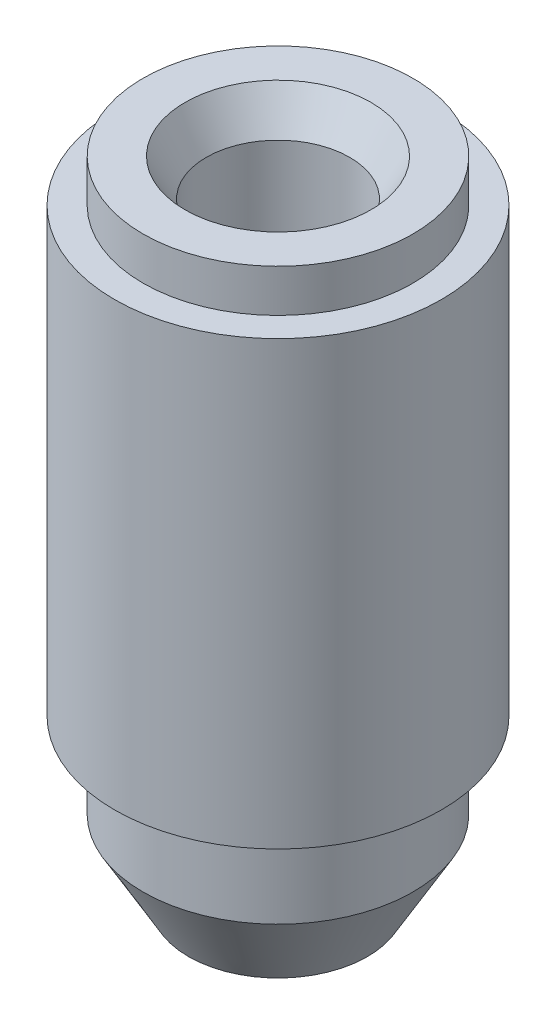
ISO-10303-21;
HEADER;
FILE_DESCRIPTION(('STEP AP214'),'2;1');
FILE_NAME('part.step','',(''),(''),'','','');
FILE_SCHEMA(('AUTOMOTIVE_DESIGN { 1 0 10303 214 1 1 1 1 }'));
ENDSEC;
DATA;
#1=APPLICATION_CONTEXT('core data for automotive mechanical design processes');
#2=APPLICATION_PROTOCOL_DEFINITION('international standard','automotive_design',2000,#1);
#3=PRODUCT_CONTEXT('',#1,'mechanical');
#4=PRODUCT('Part','Part','',(#3));
#5=PRODUCT_RELATED_PRODUCT_CATEGORY('part','',(#4));
#6=PRODUCT_DEFINITION_FORMATION('','',#4);
#7=PRODUCT_DEFINITION_CONTEXT('part definition',#1,'design');
#8=PRODUCT_DEFINITION('design','',#6,#7);
#9=PRODUCT_DEFINITION_SHAPE('','',#8);
#10=(LENGTH_UNIT() NAMED_UNIT(*) SI_UNIT(.MILLI.,.METRE.));
#11=(NAMED_UNIT(*) PLANE_ANGLE_UNIT() SI_UNIT($,.RADIAN.));
#12=(NAMED_UNIT(*) SI_UNIT($,.STERADIAN.) SOLID_ANGLE_UNIT());
#13=UNCERTAINTY_MEASURE_WITH_UNIT(LENGTH_MEASURE(1.E-05),#10,'distance_accuracy_value','');
#14=(GEOMETRIC_REPRESENTATION_CONTEXT(3) GLOBAL_UNCERTAINTY_ASSIGNED_CONTEXT((#13)) GLOBAL_UNIT_ASSIGNED_CONTEXT((#10,
#11,#12)) REPRESENTATION_CONTEXT('',''));
#15=CARTESIAN_POINT('',(0.,0.,0.));
#16=DIRECTION('',(0.,0.,1.));
#17=DIRECTION('',(1.,0.,0.));
#18=AXIS2_PLACEMENT_3D('',#15,#16,#17);
#19=CARTESIAN_POINT('',(5.05,18.56,0.));
#20=DIRECTION('',(0.,-1.,0.));
#21=DIRECTION('',(0.,0.,-1.));
#22=AXIS2_PLACEMENT_3D('',#19,#20,#21);
#23=PLANE('',#22);
#24=CARTESIAN_POINT('',(0.,18.56,0.));
#25=DIRECTION('',(0.,-1.,0.));
#26=DIRECTION('',(0.,0.,-1.));
#27=AXIS2_PLACEMENT_3D('',#24,#25,#26);
#28=CIRCLE('',#27,6.55000000000001);
#29=CARTESIAN_POINT('',(0.,18.56,-6.55000000000001));
#30=VERTEX_POINT('',#29);
#31=EDGE_CURVE('E10',#30,#30,#28,.T.);
#32=ORIENTED_EDGE('',*,*,#31,.T.);
#33=EDGE_LOOP('',(#32));
#34=FACE_BOUND('',#33,.T.);
#35=CARTESIAN_POINT('',(0.,18.56,0.));
#36=DIRECTION('',(0.,1.,0.));
#37=DIRECTION('',(0.,0.,1.));
#38=AXIS2_PLACEMENT_3D('',#35,#36,#37);
#39=CIRCLE('',#38,9.50000000000001);
#40=CARTESIAN_POINT('',(0.,18.56,9.50000000000001));
#41=VERTEX_POINT('',#40);
#42=EDGE_CURVE('E43',#41,#41,#39,.T.);
#43=ORIENTED_EDGE('',*,*,#42,.T.);
#44=EDGE_LOOP('',(#43));
#45=FACE_BOUND('',#44,.T.);
#46=ADVANCED_FACE('F32',(#34,#45),#23,.F.);
#47=CARTESIAN_POINT('',(0.,19.5331704023665,0.));
#48=DIRECTION('',(0.,1.,0.));
#49=DIRECTION('',(0.,0.,1.));
#50=AXIS2_PLACEMENT_3D('',#47,#48,#49);
#51=CYLINDRICAL_SURFACE('',#50,9.50000000000001);
#52=ORIENTED_EDGE('',*,*,#42,.F.);
#53=EDGE_LOOP('',(#52));
#54=FACE_BOUND('',#53,.T.);
#55=CARTESIAN_POINT('',(0.,15.56,0.));
#56=DIRECTION('',(0.,1.,0.));
#57=DIRECTION('',(0.,0.,1.));
#58=AXIS2_PLACEMENT_3D('',#55,#56,#57);
#59=CIRCLE('',#58,9.50000000000001);
#60=CARTESIAN_POINT('',(0.,15.56,9.50000000000001));
#61=VERTEX_POINT('',#60);
#62=EDGE_CURVE('E47',#61,#61,#59,.T.);
#63=ORIENTED_EDGE('',*,*,#62,.T.);
#64=EDGE_LOOP('',(#63));
#65=FACE_BOUND('',#64,.T.);
#66=ADVANCED_FACE('F85',(#54,#65),#51,.T.);
#67=CARTESIAN_POINT('',(9.50000000000001,15.56,0.));
#68=DIRECTION('',(0.,-1.,0.));
#69=DIRECTION('',(0.,0.,-1.));
#70=AXIS2_PLACEMENT_3D('',#67,#68,#69);
#71=PLANE('',#70);
#72=ORIENTED_EDGE('',*,*,#62,.F.);
#73=EDGE_LOOP('',(#72));
#74=FACE_BOUND('',#73,.T.);
#75=CARTESIAN_POINT('',(0.,15.56,0.));
#76=DIRECTION('',(0.,1.,0.));
#77=DIRECTION('',(0.,0.,1.));
#78=AXIS2_PLACEMENT_3D('',#75,#76,#77);
#79=CIRCLE('',#78,11.5);
#80=CARTESIAN_POINT('',(0.,15.56,11.5));
#81=VERTEX_POINT('',#80);
#82=EDGE_CURVE('E52',#81,#81,#79,.T.);
#83=ORIENTED_EDGE('',*,*,#82,.T.);
#84=EDGE_LOOP('',(#83));
#85=FACE_BOUND('',#84,.T.);
#86=ADVANCED_FACE('F89',(#74,#85),#71,.F.);
#87=CARTESIAN_POINT('',(0.,19.5331704023665,0.));
#88=DIRECTION('',(0.,1.,0.));
#89=DIRECTION('',(0.,0.,1.));
#90=AXIS2_PLACEMENT_3D('',#87,#88,#89);
#91=CYLINDRICAL_SURFACE('',#90,11.5);
#92=ORIENTED_EDGE('',*,*,#82,.F.);
#93=EDGE_LOOP('',(#92));
#94=FACE_BOUND('',#93,.T.);
#95=CARTESIAN_POINT('',(0.,-15.56,0.));
#96=DIRECTION('',(0.,1.,0.));
#97=DIRECTION('',(0.,0.,1.));
#98=AXIS2_PLACEMENT_3D('',#95,#96,#97);
#99=CIRCLE('',#98,11.5);
#100=CARTESIAN_POINT('',(0.,-15.56,11.5));
#101=VERTEX_POINT('',#100);
#102=EDGE_CURVE('E55',#101,#101,#99,.T.);
#103=ORIENTED_EDGE('',*,*,#102,.T.);
#104=EDGE_LOOP('',(#103));
#105=FACE_BOUND('',#104,.T.);
#106=ADVANCED_FACE('F96',(#94,#105),#91,.T.);
#107=CARTESIAN_POINT('',(9.50000000000001,-15.56,0.));
#108=DIRECTION('',(0.,1.,0.));
#109=DIRECTION('',(0.,0.,1.));
#110=AXIS2_PLACEMENT_3D('',#107,#108,#109);
#111=PLANE('',#110);
#112=ORIENTED_EDGE('',*,*,#102,.F.);
#113=EDGE_LOOP('',(#112));
#114=FACE_BOUND('',#113,.T.);
#115=CARTESIAN_POINT('',(0.,-15.56,0.));
#116=DIRECTION('',(0.,1.,0.));
#117=DIRECTION('',(0.,0.,1.));
#118=AXIS2_PLACEMENT_3D('',#115,#116,#117);
#119=CIRCLE('',#118,9.50000000000001);
#120=CARTESIAN_POINT('',(0.,-15.56,9.50000000000001));
#121=VERTEX_POINT('',#120);
#122=EDGE_CURVE('E58',#121,#121,#119,.T.);
#123=ORIENTED_EDGE('',*,*,#122,.T.);
#124=EDGE_LOOP('',(#123));
#125=FACE_BOUND('',#124,.T.);
#126=ADVANCED_FACE('F100',(#114,#125),#111,.F.);
#127=CARTESIAN_POINT('',(0.,19.5331704023665,0.));
#128=DIRECTION('',(0.,1.,0.));
#129=DIRECTION('',(0.,0.,1.));
#130=AXIS2_PLACEMENT_3D('',#127,#128,#129);
#131=CYLINDRICAL_SURFACE('',#130,9.50000000000002);
#132=ORIENTED_EDGE('',*,*,#122,.F.);
#133=EDGE_LOOP('',(#132));
#134=FACE_BOUND('',#133,.T.);
#135=CARTESIAN_POINT('',(0.,-21.56,0.));
#136=DIRECTION('',(0.,1.,0.));
#137=DIRECTION('',(0.,0.,1.));
#138=AXIS2_PLACEMENT_3D('',#135,#136,#137);
#139=CIRCLE('',#138,9.50000000000003);
#140=CARTESIAN_POINT('',(0.,-21.56,9.50000000000003));
#141=VERTEX_POINT('',#140);
#142=EDGE_CURVE('E61',#141,#141,#139,.T.);
#143=ORIENTED_EDGE('',*,*,#142,.T.);
#144=EDGE_LOOP('',(#143));
#145=FACE_BOUND('',#144,.T.);
#146=ADVANCED_FACE('F104',(#134,#145),#131,.T.);
#147=CARTESIAN_POINT('',(0.,-27.1025625842205,0.));
#148=DIRECTION('',(0.,1.,0.));
#149=DIRECTION('',(0.,0.,1.));
#150=AXIS2_PLACEMENT_3D('',#147,#148,#149);
#151=CONICAL_SURFACE('',#150,6.29999999999999,0.523598775598295);
#152=ORIENTED_EDGE('',*,*,#142,.F.);
#153=EDGE_LOOP('',(#152));
#154=FACE_BOUND('',#153,.T.);
#155=CARTESIAN_POINT('',(0.,-27.1025625842205,0.));
#156=DIRECTION('',(0.,1.,0.));
#157=DIRECTION('',(0.,0.,1.));
#158=AXIS2_PLACEMENT_3D('',#155,#156,#157);
#159=CIRCLE('',#158,6.29999999999999);
#160=CARTESIAN_POINT('',(0.,-27.1025625842205,6.29999999999999));
#161=VERTEX_POINT('',#160);
#162=EDGE_CURVE('E64',#161,#161,#159,.T.);
#163=ORIENTED_EDGE('',*,*,#162,.T.);
#164=EDGE_LOOP('',(#163));
#165=FACE_BOUND('',#164,.T.);
#166=ADVANCED_FACE('F81',(#154,#165),#151,.T.);
#167=CARTESIAN_POINT('',(5.05,-27.1025625842205,0.));
#168=DIRECTION('',(0.,1.,0.));
#169=DIRECTION('',(0.,0.,1.));
#170=AXIS2_PLACEMENT_3D('',#167,#168,#169);
#171=PLANE('',#170);
#172=ORIENTED_EDGE('',*,*,#162,.F.);
#173=EDGE_LOOP('',(#172));
#174=FACE_BOUND('',#173,.T.);
#175=CARTESIAN_POINT('',(0.,-27.1025625842205,0.));
#176=DIRECTION('',(0.,1.,0.));
#177=DIRECTION('',(0.,0.,1.));
#178=AXIS2_PLACEMENT_3D('',#175,#176,#177);
#179=CIRCLE('',#178,5.05);
#180=CARTESIAN_POINT('',(0.,-27.1025625842205,5.05));
#181=VERTEX_POINT('',#180);
#182=EDGE_CURVE('E67',#181,#181,#179,.T.);
#183=ORIENTED_EDGE('',*,*,#182,.T.);
#184=EDGE_LOOP('',(#183));
#185=FACE_BOUND('',#184,.T.);
#186=ADVANCED_FACE('F71',(#174,#185),#171,.F.);
#187=CARTESIAN_POINT('',(0.,19.5331704023665,0.));
#188=DIRECTION('',(0.,1.,0.));
#189=DIRECTION('',(0.,0.,1.));
#190=AXIS2_PLACEMENT_3D('',#187,#188,#189);
#191=CYLINDRICAL_SURFACE('',#190,5.05);
#192=CARTESIAN_POINT('',(0.,15.9619237886467,0.));
#193=DIRECTION('',(0.,-1.,0.));
#194=DIRECTION('',(0.,0.,-1.));
#195=AXIS2_PLACEMENT_3D('',#192,#193,#194);
#196=CIRCLE('',#195,5.05);
#197=CARTESIAN_POINT('',(0.,15.9619237886467,-5.05));
#198=VERTEX_POINT('',#197);
#199=EDGE_CURVE('E39',#198,#198,#196,.F.);
#200=ORIENTED_EDGE('',*,*,#199,.T.);
#201=EDGE_LOOP('',(#200));
#202=FACE_BOUND('',#201,.T.);
#203=ORIENTED_EDGE('',*,*,#182,.F.);
#204=EDGE_LOOP('',(#203));
#205=FACE_BOUND('',#204,.T.);
#206=ADVANCED_FACE('F73',(#202,#205),#191,.F.);
#207=CARTESIAN_POINT('',(0.,15.9619237886467,0.));
#208=DIRECTION('',(0.,1.,0.));
#209=DIRECTION('',(0.,0.,1.));
#210=AXIS2_PLACEMENT_3D('',#207,#208,#209);
#211=CONICAL_SURFACE('',#210,5.05,0.523598775598302);
#212=ORIENTED_EDGE('',*,*,#31,.F.);
#213=EDGE_LOOP('',(#212));
#214=FACE_BOUND('',#213,.T.);
#215=ORIENTED_EDGE('',*,*,#199,.F.);
#216=EDGE_LOOP('',(#215));
#217=FACE_BOUND('',#216,.T.);
#218=ADVANCED_FACE('F34',(#214,#217),#211,.F.);
#219=CLOSED_SHELL('',(#46,#66,#86,#106,#126,#146,#166,#186,#206,#218));
#220=MANIFOLD_SOLID_BREP('B2',#219);
#221=ADVANCED_BREP_SHAPE_REPRESENTATION('',(#18,#220),#14);
#222=SHAPE_DEFINITION_REPRESENTATION(#9,#221);
ENDSEC;
END-ISO-10303-21;
